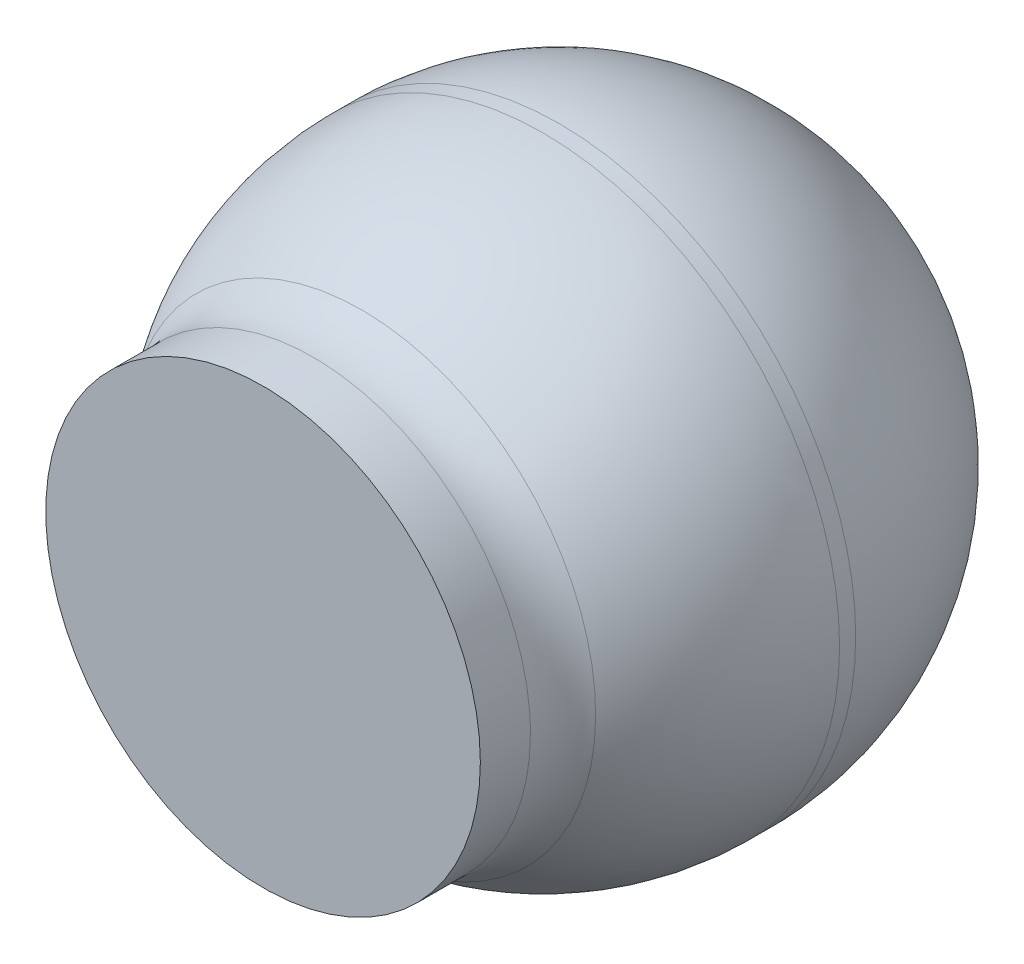
ISO-10303-21;
HEADER;
FILE_DESCRIPTION(('STEP AP214'),'2;1');
FILE_NAME('part.step','',(''),(''),'','','');
FILE_SCHEMA(('AUTOMOTIVE_DESIGN { 1 0 10303 214 1 1 1 1 }'));
ENDSEC;
DATA;
#1=APPLICATION_CONTEXT('core data for automotive mechanical design processes');
#2=APPLICATION_PROTOCOL_DEFINITION('international standard','automotive_design',2000,#1);
#3=PRODUCT_CONTEXT('',#1,'mechanical');
#4=PRODUCT('Part','Part','',(#3));
#5=PRODUCT_RELATED_PRODUCT_CATEGORY('part','',(#4));
#6=PRODUCT_DEFINITION_FORMATION('','',#4);
#7=PRODUCT_DEFINITION_CONTEXT('part definition',#1,'design');
#8=PRODUCT_DEFINITION('design','',#6,#7);
#9=PRODUCT_DEFINITION_SHAPE('','',#8);
#10=(LENGTH_UNIT() NAMED_UNIT(*) SI_UNIT(.MILLI.,.METRE.));
#11=(NAMED_UNIT(*) PLANE_ANGLE_UNIT() SI_UNIT($,.RADIAN.));
#12=(NAMED_UNIT(*) SI_UNIT($,.STERADIAN.) SOLID_ANGLE_UNIT());
#13=UNCERTAINTY_MEASURE_WITH_UNIT(LENGTH_MEASURE(1.E-05),#10,'distance_accuracy_value','');
#14=(GEOMETRIC_REPRESENTATION_CONTEXT(3) GLOBAL_UNCERTAINTY_ASSIGNED_CONTEXT((#13)) GLOBAL_UNIT_ASSIGNED_CONTEXT((#10,
#11,#12)) REPRESENTATION_CONTEXT('',''));
#15=CARTESIAN_POINT('',(0.,0.,0.));
#16=DIRECTION('',(0.,0.,1.));
#17=DIRECTION('',(1.,0.,0.));
#18=AXIS2_PLACEMENT_3D('',#15,#16,#17);
#19=CARTESIAN_POINT('',(-0.562919922269,-4.051349291452,10.006534503384));
#20=DIRECTION('',(0.,0.,-1.));
#21=DIRECTION('',(-1.,0.,0.));
#22=AXIS2_PLACEMENT_3D('',#19,#20,#21);
#23=PLANE('',#22);
#24=CARTESIAN_POINT('',(-0.562919922269,-4.051349291452,10.006534503384));
#25=DIRECTION('',(0.,0.,1.));
#26=DIRECTION('',(1.,0.,0.));
#27=AXIS2_PLACEMENT_3D('',#24,#25,#26);
#28=CIRCLE('',#27,0.275);
#29=CARTESIAN_POINT('',(-0.287919922269,-4.051349291452,10.006534503384));
#30=VERTEX_POINT('',#29);
#31=EDGE_CURVE('E20',#30,#30,#28,.F.);
#32=ORIENTED_EDGE('',*,*,#31,.F.);
#33=EDGE_LOOP('',(#32));
#34=FACE_BOUND('',#33,.T.);
#35=ADVANCED_FACE('F17',(#34),#23,.F.);
#36=CARTESIAN_POINT('',(-0.562919922269,-4.051349291452,9.906534503384));
#37=DIRECTION('',(0.,0.,1.));
#38=DIRECTION('',(1.,0.,0.));
#39=AXIS2_PLACEMENT_3D('',#36,#37,#38);
#40=CYLINDRICAL_SURFACE('',#39,0.275);
#41=CARTESIAN_POINT('',(-0.562919922269,-4.051349291452,9.943180457728));
#42=DIRECTION('',(0.,0.,-1.));
#43=DIRECTION('',(0.996700902337583,0.0811622527992438,0.));
#44=AXIS2_PLACEMENT_3D('',#41,#42,#43);
#45=CIRCLE('',#44,0.275);
#46=CARTESIAN_POINT('',(-0.288827174126165,-4.02902967193221,9.943180457728));
#47=VERTEX_POINT('',#46);
#48=EDGE_CURVE('E65',#47,#47,#45,.F.);
#49=ORIENTED_EDGE('',*,*,#48,.T.);
#50=EDGE_LOOP('',(#49));
#51=FACE_BOUND('',#50,.T.);
#52=ORIENTED_EDGE('',*,*,#31,.T.);
#53=EDGE_LOOP('',(#52));
#54=FACE_BOUND('',#53,.T.);
#55=ADVANCED_FACE('F62',(#51,#54),#40,.T.);
#56=CARTESIAN_POINT('',(-0.562919922269,-4.051349291452,9.943180457728));
#57=DIRECTION('',(0.,0.,-1.));
#58=DIRECTION('',(0.996700902337583,0.0811622527992449,0.));
#59=AXIS2_PLACEMENT_3D('',#56,#57,#58);
#60=TOROIDAL_SURFACE('',#59,0.375,0.1);
#61=ORIENTED_EDGE('',*,*,#48,.F.);
#62=EDGE_LOOP('',(#61));
#63=FACE_BOUND('',#62,.T.);
#64=CARTESIAN_POINT('',(-0.562919922268999,-4.051349291452,9.881744931236));
#65=DIRECTION('',(0.,0.,-1.));
#66=DIRECTION('',(-0.996700902337598,-0.0811622527990593,0.));
#67=AXIS2_PLACEMENT_3D('',#64,#65,#66);
#68=CIRCLE('',#67,0.296097046412665);
#69=CARTESIAN_POINT('',(-0.858040115608,-4.075381194786,9.881744931236));
#70=VERTEX_POINT('',#69);
#71=EDGE_CURVE('E39',#70,#70,#68,.T.);
#72=ORIENTED_EDGE('',*,*,#71,.F.);
#73=EDGE_LOOP('',(#72));
#74=FACE_BOUND('',#73,.T.);
#75=ADVANCED_FACE('F57',(#63,#74),#60,.F.);
#76=CARTESIAN_POINT('',(-0.936682760645,-4.081785136252,9.651976062157));
#77=CARTESIAN_POINT('',(-0.936682760645,-4.081785136252,9.701461392103));
#78=CARTESIAN_POINT('',(-0.928526217348,-4.081120941579,9.750947004335));
#79=CARTESIAN_POINT('',(-0.912207085349,-4.079792059952,9.798626332798));
#80=CARTESIAN_POINT('',(-0.888341390838,-4.077848654938,9.842699544317));
#81=CARTESIAN_POINT('',(-0.858040115608,-4.075381194786,9.881744931236));
#82=(BOUNDED_CURVE() B_SPLINE_CURVE(5,(#76,#77,#78,#79,#80,#81),.UNSPECIFIED.,.F.,
.F.) B_SPLINE_CURVE_WITH_KNOTS((6,6),(0.,0.661568582165),
.UNSPECIFIED.) CURVE() GEOMETRIC_REPRESENTATION_ITEM() RATIONAL_B_SPLINE_CURVE((1.,1.,1.,1.,1.,1.)) REPRESENTATION_ITEM(''));
#83=CARTESIAN_POINT('',(-0.562919922269,-4.051349291452,9.651976062157));
#84=DIRECTION('',(0.,0.,-1.));
#85=AXIS1_PLACEMENT('',#83,#84);
#86=SURFACE_OF_REVOLUTION('',#82,#85);
#87=CARTESIAN_POINT('',(-0.562919922268999,-4.051349291452,9.651976062157));
#88=DIRECTION('',(0.,0.,1.));
#89=DIRECTION('',(1.,0.,0.));
#90=AXIS2_PLACEMENT_3D('',#87,#88,#89);
#91=CIRCLE('',#90,0.375);
#92=CARTESIAN_POINT('',(-0.187919922268999,-4.051349291452,9.651976062157));
#93=VERTEX_POINT('',#92);
#94=EDGE_CURVE('E36',#93,#93,#91,.F.);
#95=ORIENTED_EDGE('',*,*,#94,.F.);
#96=EDGE_LOOP('',(#95));
#97=FACE_BOUND('',#96,.T.);
#98=ORIENTED_EDGE('',*,*,#71,.T.);
#99=EDGE_LOOP('',(#98));
#100=FACE_BOUND('',#99,.T.);
#101=ADVANCED_FACE('F53',(#97,#100),#86,.F.);
#102=CARTESIAN_POINT('',(-0.562919922269,-4.051349291452,9.256534503384));
#103=DIRECTION('',(0.,0.,1.));
#104=DIRECTION('',(1.,0.,0.));
#105=AXIS2_PLACEMENT_3D('',#102,#103,#104);
#106=CYLINDRICAL_SURFACE('',#105,0.375);
#107=CARTESIAN_POINT('',(-0.562919922269,-4.051349291452,9.631534503384));
#108=DIRECTION('',(0.,0.,-1.));
#109=DIRECTION('',(0.0811622527992362,-0.996700902337583,0.));
#110=AXIS2_PLACEMENT_3D('',#107,#108,#109);
#111=CIRCLE('',#110,0.375);
#112=CARTESIAN_POINT('',(-0.532484077469286,-4.4251121298286,9.631534503384));
#113=VERTEX_POINT('',#112);
#114=CARTESIAN_POINT('',(-0.593355767068714,-3.67758645307541,9.631534503384));
#115=VERTEX_POINT('',#114);
#116=EDGE_CURVE('E11',#113,#115,#111,.T.);
#117=ORIENTED_EDGE('',*,*,#116,.F.);
#118=CARTESIAN_POINT('',(-0.562919922269,-4.051349291452,9.631534503384));
#119=DIRECTION('',(0.,0.,1.));
#120=DIRECTION('',(0.0811622527992359,-0.996700902337583,0.));
#121=AXIS2_PLACEMENT_3D('',#118,#119,#120);
#122=CIRCLE('',#121,0.375);
#123=EDGE_CURVE('E25',#115,#113,#122,.F.);
#124=ORIENTED_EDGE('',*,*,#123,.F.);
#125=EDGE_LOOP('',(#117,#124));
#126=FACE_BOUND('',#125,.T.);
#127=ORIENTED_EDGE('',*,*,#94,.T.);
#128=EDGE_LOOP('',(#127));
#129=FACE_BOUND('',#128,.T.);
#130=ADVANCED_FACE('F34',(#126,#129),#106,.T.);
#131=CARTESIAN_POINT('',(-0.562919922269,-4.051349291452,9.631534503384));
#132=DIRECTION('',(0.0811622527992361,-0.996700902337583,0.));
#133=DIRECTION('',(-0.996700902337583,-0.0811622527992361,0.));
#134=AXIS2_PLACEMENT_3D('',#131,#132,#133);
#135=SPHERICAL_SURFACE('',#134,0.375);
#136=ORIENTED_EDGE('',*,*,#123,.T.);
#137=ORIENTED_EDGE('',*,*,#116,.T.);
#138=EDGE_LOOP('',(#136,#137));
#139=FACE_BOUND('',#138,.T.);
#140=ADVANCED_FACE('F32',(#139),#135,.T.);
#141=CLOSED_SHELL('',(#35,#55,#75,#101,#130,#140));
#142=MANIFOLD_SOLID_BREP('B1',#141);
#143=ADVANCED_BREP_SHAPE_REPRESENTATION('',(#18,#142),#14);
#144=SHAPE_DEFINITION_REPRESENTATION(#9,#143);
ENDSEC;
END-ISO-10303-21;
